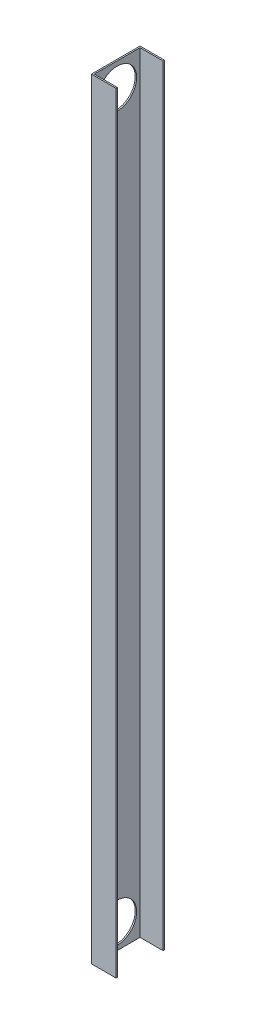
ISO-10303-21;
HEADER;
FILE_DESCRIPTION(('STEP AP214'),'2;1');
FILE_NAME('part.step','',(''),(''),'','','');
FILE_SCHEMA(('AUTOMOTIVE_DESIGN { 1 0 10303 214 1 1 1 1 }'));
ENDSEC;
DATA;
#1=APPLICATION_CONTEXT('core data for automotive mechanical design processes');
#2=APPLICATION_PROTOCOL_DEFINITION('international standard','automotive_design',2000,#1);
#3=PRODUCT_CONTEXT('',#1,'mechanical');
#4=PRODUCT('Part','Part','',(#3));
#5=PRODUCT_RELATED_PRODUCT_CATEGORY('part','',(#4));
#6=PRODUCT_DEFINITION_FORMATION('','',#4);
#7=PRODUCT_DEFINITION_CONTEXT('part definition',#1,'design');
#8=PRODUCT_DEFINITION('design','',#6,#7);
#9=PRODUCT_DEFINITION_SHAPE('','',#8);
#10=(LENGTH_UNIT() NAMED_UNIT(*) SI_UNIT(.MILLI.,.METRE.));
#11=(NAMED_UNIT(*) PLANE_ANGLE_UNIT() SI_UNIT($,.RADIAN.));
#12=(NAMED_UNIT(*) SI_UNIT($,.STERADIAN.) SOLID_ANGLE_UNIT());
#13=UNCERTAINTY_MEASURE_WITH_UNIT(LENGTH_MEASURE(1.E-05),#10,'distance_accuracy_value','');
#14=(GEOMETRIC_REPRESENTATION_CONTEXT(3) GLOBAL_UNCERTAINTY_ASSIGNED_CONTEXT((#13)) GLOBAL_UNIT_ASSIGNED_CONTEXT((#10,
#11,#12)) REPRESENTATION_CONTEXT('',''));
#15=CARTESIAN_POINT('',(0.,0.,0.));
#16=DIRECTION('',(0.,0.,1.));
#17=DIRECTION('',(1.,0.,0.));
#18=AXIS2_PLACEMENT_3D('',#15,#16,#17);
#19=CARTESIAN_POINT('',(25.5000000000002,1600.,1.17961196366424E-13));
#20=DIRECTION('',(1.,0.,0.));
#21=DIRECTION('',(0.,0.,-1.));
#22=AXIS2_PLACEMENT_3D('',#19,#20,#21);
#23=PLANE('',#22);
#24=DIRECTION('',(0.,0.,1.));
#25=VECTOR('',#24,1.);
#26=CARTESIAN_POINT('',(25.5000000000002,0.,1.17961196366424E-13));
#27=LINE('',#26,#25);
#28=CARTESIAN_POINT('',(25.5,0.,47.5));
#29=VERTEX_POINT('',#28);
#30=CARTESIAN_POINT('',(25.5,0.,50.5));
#31=VERTEX_POINT('',#30);
#32=EDGE_CURVE('E142',#29,#31,#27,.T.);
#33=ORIENTED_EDGE('',*,*,#32,.F.);
#34=DIRECTION('',(0.,-1.,0.));
#35=VECTOR('',#34,1.);
#36=CARTESIAN_POINT('',(25.5,1600.,47.5));
#37=LINE('',#36,#35);
#38=CARTESIAN_POINT('',(25.5,1600.,47.5));
#39=VERTEX_POINT('',#38);
#40=EDGE_CURVE('E11',#39,#29,#37,.T.);
#41=ORIENTED_EDGE('',*,*,#40,.F.);
#42=DIRECTION('',(0.,0.,1.));
#43=VECTOR('',#42,1.);
#44=CARTESIAN_POINT('',(25.5000000000002,1600.,1.17961196366424E-13));
#45=LINE('',#44,#43);
#46=CARTESIAN_POINT('',(25.5,1600.,50.5));
#47=VERTEX_POINT('',#46);
#48=EDGE_CURVE('E170',#39,#47,#45,.T.);
#49=ORIENTED_EDGE('',*,*,#48,.T.);
#50=DIRECTION('',(0.,-1.,0.));
#51=VECTOR('',#50,1.);
#52=CARTESIAN_POINT('',(25.5,1600.,50.5));
#53=LINE('',#52,#51);
#54=EDGE_CURVE('E94',#47,#31,#53,.T.);
#55=ORIENTED_EDGE('',*,*,#54,.T.);
#56=EDGE_LOOP('',(#33,#41,#49,#55));
#57=FACE_BOUND('',#56,.T.);
#58=ADVANCED_FACE('F43',(#57),#23,.T.);
#59=CARTESIAN_POINT('',(0.,1600.,47.5));
#60=DIRECTION('',(0.,0.,-1.));
#61=DIRECTION('',(-1.,0.,0.));
#62=AXIS2_PLACEMENT_3D('',#59,#60,#61);
#63=PLANE('',#62);
#64=DIRECTION('',(1.,0.,0.));
#65=VECTOR('',#64,1.);
#66=CARTESIAN_POINT('',(0.,0.,47.5));
#67=LINE('',#66,#65);
#68=CARTESIAN_POINT('',(-22.5,0.,47.5));
#69=VERTEX_POINT('',#68);
#70=EDGE_CURVE('E146',#69,#29,#67,.T.);
#71=ORIENTED_EDGE('',*,*,#70,.F.);
#72=DIRECTION('',(0.,-1.,0.));
#73=VECTOR('',#72,1.);
#74=CARTESIAN_POINT('',(-22.5,1600.,47.5));
#75=LINE('',#74,#73);
#76=CARTESIAN_POINT('',(-22.5,1600.,47.5));
#77=VERTEX_POINT('',#76);
#78=EDGE_CURVE('E52',#77,#69,#75,.T.);
#79=ORIENTED_EDGE('',*,*,#78,.F.);
#80=DIRECTION('',(1.,0.,0.));
#81=VECTOR('',#80,1.);
#82=CARTESIAN_POINT('',(0.,1600.,47.5));
#83=LINE('',#82,#81);
#84=EDGE_CURVE('E203',#77,#39,#83,.T.);
#85=ORIENTED_EDGE('',*,*,#84,.T.);
#86=ORIENTED_EDGE('',*,*,#40,.T.);
#87=EDGE_LOOP('',(#71,#79,#85,#86));
#88=FACE_BOUND('',#87,.T.);
#89=ADVANCED_FACE('F193',(#88),#63,.T.);
#90=CARTESIAN_POINT('',(-22.5,1600.,0.));
#91=DIRECTION('',(1.,0.,0.));
#92=DIRECTION('',(0.,0.,-1.));
#93=AXIS2_PLACEMENT_3D('',#90,#91,#92);
#94=PLANE('',#93);
#95=CARTESIAN_POINT('',(-22.5,50.,0.));
#96=DIRECTION('',(1.,0.,0.));
#97=DIRECTION('',(0.,0.,-1.));
#98=AXIS2_PLACEMENT_3D('',#95,#96,#97);
#99=CIRCLE('',#98,40.5);
#100=CARTESIAN_POINT('',(-22.5,50.,-40.5));
#101=VERTEX_POINT('',#100);
#102=EDGE_CURVE('E147',#101,#101,#99,.T.);
#103=ORIENTED_EDGE('',*,*,#102,.F.);
#104=EDGE_LOOP('',(#103));
#105=FACE_BOUND('',#104,.T.);
#106=CARTESIAN_POINT('',(-22.5,1550.,0.));
#107=DIRECTION('',(1.,0.,0.));
#108=DIRECTION('',(0.,0.,-1.));
#109=AXIS2_PLACEMENT_3D('',#106,#107,#108);
#110=CIRCLE('',#109,40.5);
#111=CARTESIAN_POINT('',(-22.5,1550.,-40.5));
#112=VERTEX_POINT('',#111);
#113=EDGE_CURVE('E214',#112,#112,#110,.T.);
#114=ORIENTED_EDGE('',*,*,#113,.F.);
#115=EDGE_LOOP('',(#114));
#116=FACE_BOUND('',#115,.T.);
#117=DIRECTION('',(0.,0.,1.));
#118=VECTOR('',#117,1.);
#119=CARTESIAN_POINT('',(-22.5,0.,0.));
#120=LINE('',#119,#118);
#121=CARTESIAN_POINT('',(-22.5,0.,-47.5));
#122=VERTEX_POINT('',#121);
#123=EDGE_CURVE('E151',#122,#69,#120,.T.);
#124=ORIENTED_EDGE('',*,*,#123,.F.);
#125=DIRECTION('',(0.,-1.,0.));
#126=VECTOR('',#125,1.);
#127=CARTESIAN_POINT('',(-22.5,1600.,-47.5));
#128=LINE('',#127,#126);
#129=CARTESIAN_POINT('',(-22.5,1600.,-47.5));
#130=VERTEX_POINT('',#129);
#131=EDGE_CURVE('E180',#130,#122,#128,.T.);
#132=ORIENTED_EDGE('',*,*,#131,.F.);
#133=DIRECTION('',(0.,0.,1.));
#134=VECTOR('',#133,1.);
#135=CARTESIAN_POINT('',(-22.5,1600.,0.));
#136=LINE('',#135,#134);
#137=EDGE_CURVE('E189',#130,#77,#136,.T.);
#138=ORIENTED_EDGE('',*,*,#137,.T.);
#139=ORIENTED_EDGE('',*,*,#78,.T.);
#140=EDGE_LOOP('',(#124,#132,#138,#139));
#141=FACE_BOUND('',#140,.T.);
#142=ADVANCED_FACE('F187',(#105,#116,#141),#94,.T.);
#143=CARTESIAN_POINT('',(0.,1600.,-47.5));
#144=DIRECTION('',(0.,0.,-1.));
#145=DIRECTION('',(-1.,0.,0.));
#146=AXIS2_PLACEMENT_3D('',#143,#144,#145);
#147=PLANE('',#146);
#148=DIRECTION('',(1.,0.,0.));
#149=VECTOR('',#148,1.);
#150=CARTESIAN_POINT('',(0.,0.,-47.5));
#151=LINE('',#150,#149);
#152=CARTESIAN_POINT('',(25.5,0.,-47.5));
#153=VERTEX_POINT('',#152);
#154=EDGE_CURVE('E155',#122,#153,#151,.T.);
#155=ORIENTED_EDGE('',*,*,#154,.T.);
#156=DIRECTION('',(0.,-1.,0.));
#157=VECTOR('',#156,1.);
#158=CARTESIAN_POINT('',(25.5,1600.,-47.5));
#159=LINE('',#158,#157);
#160=CARTESIAN_POINT('',(25.5,1600.,-47.5));
#161=VERTEX_POINT('',#160);
#162=EDGE_CURVE('E177',#161,#153,#159,.T.);
#163=ORIENTED_EDGE('',*,*,#162,.F.);
#164=DIRECTION('',(1.,0.,0.));
#165=VECTOR('',#164,1.);
#166=CARTESIAN_POINT('',(0.,1600.,-47.5));
#167=LINE('',#166,#165);
#168=EDGE_CURVE('E136',#130,#161,#167,.T.);
#169=ORIENTED_EDGE('',*,*,#168,.F.);
#170=ORIENTED_EDGE('',*,*,#131,.T.);
#171=EDGE_LOOP('',(#155,#163,#169,#170));
#172=FACE_BOUND('',#171,.T.);
#173=ADVANCED_FACE('F200',(#172),#147,.F.);
#174=CARTESIAN_POINT('',(25.5000000000002,1600.,-1.17961196366424E-13));
#175=DIRECTION('',(1.,0.,0.));
#176=DIRECTION('',(0.,0.,-1.));
#177=AXIS2_PLACEMENT_3D('',#174,#175,#176);
#178=PLANE('',#177);
#179=DIRECTION('',(0.,0.,1.));
#180=VECTOR('',#179,1.);
#181=CARTESIAN_POINT('',(25.5000000000002,0.,-1.17961196366424E-13));
#182=LINE('',#181,#180);
#183=CARTESIAN_POINT('',(25.5,0.,-50.5));
#184=VERTEX_POINT('',#183);
#185=EDGE_CURVE('E159',#184,#153,#182,.T.);
#186=ORIENTED_EDGE('',*,*,#185,.F.);
#187=DIRECTION('',(0.,-1.,0.));
#188=VECTOR('',#187,1.);
#189=CARTESIAN_POINT('',(25.5,1600.,-50.5));
#190=LINE('',#189,#188);
#191=CARTESIAN_POINT('',(25.5,1600.,-50.5));
#192=VERTEX_POINT('',#191);
#193=EDGE_CURVE('E122',#192,#184,#190,.T.);
#194=ORIENTED_EDGE('',*,*,#193,.F.);
#195=DIRECTION('',(0.,0.,1.));
#196=VECTOR('',#195,1.);
#197=CARTESIAN_POINT('',(25.5000000000002,1600.,-1.17961196366424E-13));
#198=LINE('',#197,#196);
#199=EDGE_CURVE('E132',#192,#161,#198,.T.);
#200=ORIENTED_EDGE('',*,*,#199,.T.);
#201=ORIENTED_EDGE('',*,*,#162,.T.);
#202=EDGE_LOOP('',(#186,#194,#200,#201));
#203=FACE_BOUND('',#202,.T.);
#204=ADVANCED_FACE('F261',(#203),#178,.T.);
#205=CARTESIAN_POINT('',(0.,1600.,-50.5));
#206=DIRECTION('',(0.,0.,-1.));
#207=DIRECTION('',(-1.,0.,0.));
#208=AXIS2_PLACEMENT_3D('',#205,#206,#207);
#209=PLANE('',#208);
#210=DIRECTION('',(1.,0.,0.));
#211=VECTOR('',#210,1.);
#212=CARTESIAN_POINT('',(0.,0.,-50.5));
#213=LINE('',#212,#211);
#214=CARTESIAN_POINT('',(-25.5,0.,-50.5));
#215=VERTEX_POINT('',#214);
#216=EDGE_CURVE('E120',#215,#184,#213,.T.);
#217=ORIENTED_EDGE('',*,*,#216,.F.);
#218=DIRECTION('',(0.,-1.,0.));
#219=VECTOR('',#218,1.);
#220=CARTESIAN_POINT('',(-25.5,1600.,-50.5));
#221=LINE('',#220,#219);
#222=CARTESIAN_POINT('',(-25.5,1600.,-50.5));
#223=VERTEX_POINT('',#222);
#224=EDGE_CURVE('E114',#223,#215,#221,.T.);
#225=ORIENTED_EDGE('',*,*,#224,.F.);
#226=DIRECTION('',(1.,0.,0.));
#227=VECTOR('',#226,1.);
#228=CARTESIAN_POINT('',(0.,1600.,-50.5));
#229=LINE('',#228,#227);
#230=EDGE_CURVE('E118',#223,#192,#229,.T.);
#231=ORIENTED_EDGE('',*,*,#230,.T.);
#232=ORIENTED_EDGE('',*,*,#193,.T.);
#233=EDGE_LOOP('',(#217,#225,#231,#232));
#234=FACE_BOUND('',#233,.T.);
#235=ADVANCED_FACE('F116',(#234),#209,.T.);
#236=CARTESIAN_POINT('',(-25.5,1600.,0.));
#237=DIRECTION('',(1.,0.,0.));
#238=DIRECTION('',(0.,0.,-1.));
#239=AXIS2_PLACEMENT_3D('',#236,#237,#238);
#240=PLANE('',#239);
#241=CARTESIAN_POINT('',(-25.5,50.,0.));
#242=DIRECTION('',(-1.,0.,0.));
#243=DIRECTION('',(0.,0.,1.));
#244=AXIS2_PLACEMENT_3D('',#241,#242,#243);
#245=CIRCLE('',#244,40.5);
#246=CARTESIAN_POINT('',(-25.5,50.,40.5));
#247=VERTEX_POINT('',#246);
#248=EDGE_CURVE('E218',#247,#247,#245,.T.);
#249=ORIENTED_EDGE('',*,*,#248,.F.);
#250=EDGE_LOOP('',(#249));
#251=FACE_BOUND('',#250,.T.);
#252=CARTESIAN_POINT('',(-25.5,1550.,0.));
#253=DIRECTION('',(-1.,0.,0.));
#254=DIRECTION('',(0.,0.,1.));
#255=AXIS2_PLACEMENT_3D('',#252,#253,#254);
#256=CIRCLE('',#255,40.5);
#257=CARTESIAN_POINT('',(-25.5,1550.,40.5));
#258=VERTEX_POINT('',#257);
#259=EDGE_CURVE('E219',#258,#258,#256,.T.);
#260=ORIENTED_EDGE('',*,*,#259,.F.);
#261=EDGE_LOOP('',(#260));
#262=FACE_BOUND('',#261,.T.);
#263=DIRECTION('',(0.,0.,1.));
#264=VECTOR('',#263,1.);
#265=CARTESIAN_POINT('',(-25.5,0.,0.));
#266=LINE('',#265,#264);
#267=CARTESIAN_POINT('',(-25.5,0.,50.5));
#268=VERTEX_POINT('',#267);
#269=EDGE_CURVE('E87',#215,#268,#266,.T.);
#270=ORIENTED_EDGE('',*,*,#269,.T.);
#271=DIRECTION('',(0.,-1.,0.));
#272=VECTOR('',#271,1.);
#273=CARTESIAN_POINT('',(-25.5,1600.,50.5));
#274=LINE('',#273,#272);
#275=CARTESIAN_POINT('',(-25.5,1600.,50.5));
#276=VERTEX_POINT('',#275);
#277=EDGE_CURVE('E123',#276,#268,#274,.T.);
#278=ORIENTED_EDGE('',*,*,#277,.F.);
#279=DIRECTION('',(0.,0.,1.));
#280=VECTOR('',#279,1.);
#281=CARTESIAN_POINT('',(-25.5,1600.,0.));
#282=LINE('',#281,#280);
#283=EDGE_CURVE('E125',#223,#276,#282,.T.);
#284=ORIENTED_EDGE('',*,*,#283,.F.);
#285=ORIENTED_EDGE('',*,*,#224,.T.);
#286=EDGE_LOOP('',(#270,#278,#284,#285));
#287=FACE_BOUND('',#286,.T.);
#288=ADVANCED_FACE('F126',(#251,#262,#287),#240,.F.);
#289=CARTESIAN_POINT('',(0.,1600.,50.5));
#290=DIRECTION('',(0.,0.,-1.));
#291=DIRECTION('',(-1.,0.,0.));
#292=AXIS2_PLACEMENT_3D('',#289,#290,#291);
#293=PLANE('',#292);
#294=DIRECTION('',(1.,0.,0.));
#295=VECTOR('',#294,1.);
#296=CARTESIAN_POINT('',(0.,0.,50.5));
#297=LINE('',#296,#295);
#298=EDGE_CURVE('E167',#268,#31,#297,.T.);
#299=ORIENTED_EDGE('',*,*,#298,.T.);
#300=ORIENTED_EDGE('',*,*,#54,.F.);
#301=DIRECTION('',(1.,0.,0.));
#302=VECTOR('',#301,1.);
#303=CARTESIAN_POINT('',(0.,1600.,50.5));
#304=LINE('',#303,#302);
#305=EDGE_CURVE('E60',#276,#47,#304,.T.);
#306=ORIENTED_EDGE('',*,*,#305,.F.);
#307=ORIENTED_EDGE('',*,*,#277,.T.);
#308=EDGE_LOOP('',(#299,#300,#306,#307));
#309=FACE_BOUND('',#308,.T.);
#310=ADVANCED_FACE('F231',(#309),#293,.F.);
#311=CARTESIAN_POINT('',(0.,1600.,0.));
#312=DIRECTION('',(0.,1.,0.));
#313=DIRECTION('',(0.,0.,1.));
#314=AXIS2_PLACEMENT_3D('',#311,#312,#313);
#315=PLANE('',#314);
#316=ORIENTED_EDGE('',*,*,#48,.F.);
#317=ORIENTED_EDGE('',*,*,#84,.F.);
#318=ORIENTED_EDGE('',*,*,#137,.F.);
#319=ORIENTED_EDGE('',*,*,#168,.T.);
#320=ORIENTED_EDGE('',*,*,#199,.F.);
#321=ORIENTED_EDGE('',*,*,#230,.F.);
#322=ORIENTED_EDGE('',*,*,#283,.T.);
#323=ORIENTED_EDGE('',*,*,#305,.T.);
#324=EDGE_LOOP('',(#316,#317,#318,#319,#320,#321,#322,#323));
#325=FACE_BOUND('',#324,.T.);
#326=ADVANCED_FACE('F130',(#325),#315,.T.);
#327=CARTESIAN_POINT('',(0.,0.,0.));
#328=DIRECTION('',(0.,1.,0.));
#329=DIRECTION('',(0.,0.,1.));
#330=AXIS2_PLACEMENT_3D('',#327,#328,#329);
#331=PLANE('',#330);
#332=ORIENTED_EDGE('',*,*,#32,.T.);
#333=ORIENTED_EDGE('',*,*,#298,.F.);
#334=ORIENTED_EDGE('',*,*,#269,.F.);
#335=ORIENTED_EDGE('',*,*,#216,.T.);
#336=ORIENTED_EDGE('',*,*,#185,.T.);
#337=ORIENTED_EDGE('',*,*,#154,.F.);
#338=ORIENTED_EDGE('',*,*,#123,.T.);
#339=ORIENTED_EDGE('',*,*,#70,.T.);
#340=EDGE_LOOP('',(#332,#333,#334,#335,#336,#337,#338,#339));
#341=FACE_BOUND('',#340,.T.);
#342=ADVANCED_FACE('F196',(#341),#331,.F.);
#343=CARTESIAN_POINT('',(25.5,1550.,0.));
#344=DIRECTION('',(-1.,0.,0.));
#345=DIRECTION('',(0.,0.,1.));
#346=AXIS2_PLACEMENT_3D('',#343,#344,#345);
#347=CYLINDRICAL_SURFACE('',#346,40.5);
#348=ORIENTED_EDGE('',*,*,#113,.T.);
#349=EDGE_LOOP('',(#348));
#350=FACE_BOUND('',#349,.T.);
#351=ORIENTED_EDGE('',*,*,#259,.T.);
#352=EDGE_LOOP('',(#351));
#353=FACE_BOUND('',#352,.T.);
#354=ADVANCED_FACE('F235',(#350,#353),#347,.F.);
#355=CARTESIAN_POINT('',(25.5,50.,0.));
#356=DIRECTION('',(-1.,0.,0.));
#357=DIRECTION('',(0.,0.,1.));
#358=AXIS2_PLACEMENT_3D('',#355,#356,#357);
#359=CYLINDRICAL_SURFACE('',#358,40.5);
#360=ORIENTED_EDGE('',*,*,#102,.T.);
#361=EDGE_LOOP('',(#360));
#362=FACE_BOUND('',#361,.T.);
#363=ORIENTED_EDGE('',*,*,#248,.T.);
#364=EDGE_LOOP('',(#363));
#365=FACE_BOUND('',#364,.T.);
#366=ADVANCED_FACE('F227',(#362,#365),#359,.F.);
#367=CLOSED_SHELL('',(#58,#89,#142,#173,#204,#235,#288,#310,#326,#342,#354,#366));
#368=MANIFOLD_SOLID_BREP('B2',#367);
#369=ADVANCED_BREP_SHAPE_REPRESENTATION('',(#18,#368),#14);
#370=SHAPE_DEFINITION_REPRESENTATION(#9,#369);
ENDSEC;
END-ISO-10303-21;
